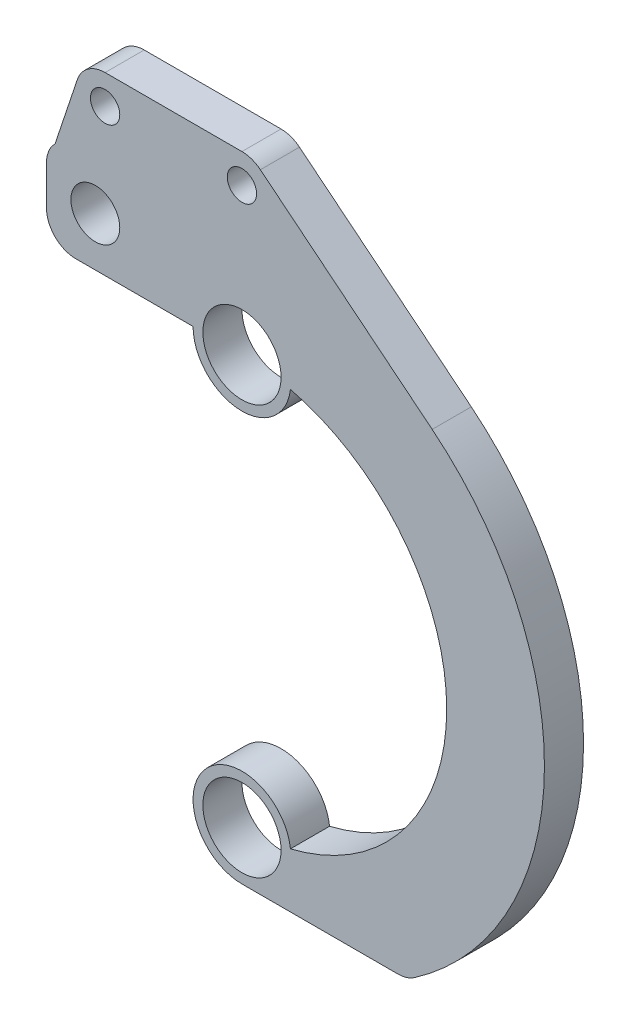
ISO-10303-21;
HEADER;
FILE_DESCRIPTION(('STEP AP214'),'2;1');
FILE_NAME('part.step','',(''),(''),'','','');
FILE_SCHEMA(('AUTOMOTIVE_DESIGN { 1 0 10303 214 1 1 1 1 }'));
ENDSEC;
DATA;
#1=APPLICATION_CONTEXT('core data for automotive mechanical design processes');
#2=APPLICATION_PROTOCOL_DEFINITION('international standard','automotive_design',2000,#1);
#3=PRODUCT_CONTEXT('',#1,'mechanical');
#4=PRODUCT('Part','Part','',(#3));
#5=PRODUCT_RELATED_PRODUCT_CATEGORY('part','',(#4));
#6=PRODUCT_DEFINITION_FORMATION('','',#4);
#7=PRODUCT_DEFINITION_CONTEXT('part definition',#1,'design');
#8=PRODUCT_DEFINITION('design','',#6,#7);
#9=PRODUCT_DEFINITION_SHAPE('','',#8);
#10=(LENGTH_UNIT() NAMED_UNIT(*) SI_UNIT(.MILLI.,.METRE.));
#11=(NAMED_UNIT(*) PLANE_ANGLE_UNIT() SI_UNIT($,.RADIAN.));
#12=(NAMED_UNIT(*) SI_UNIT($,.STERADIAN.) SOLID_ANGLE_UNIT());
#13=UNCERTAINTY_MEASURE_WITH_UNIT(LENGTH_MEASURE(1.E-05),#10,'distance_accuracy_value','');
#14=(GEOMETRIC_REPRESENTATION_CONTEXT(3) GLOBAL_UNCERTAINTY_ASSIGNED_CONTEXT((#13)) GLOBAL_UNIT_ASSIGNED_CONTEXT((#10,
#11,#12)) REPRESENTATION_CONTEXT('',''));
#15=CARTESIAN_POINT('',(0.,0.,0.));
#16=DIRECTION('',(0.,0.,1.));
#17=DIRECTION('',(1.,0.,0.));
#18=AXIS2_PLACEMENT_3D('',#15,#16,#17);
#19=CARTESIAN_POINT('',(-26.2297262447128,8.7412550388306,4.));
#20=DIRECTION('',(0.948704856693015,-0.316163082739092,0.));
#21=DIRECTION('',(0.316163082739092,0.948704856693015,0.));
#22=AXIS2_PLACEMENT_3D('',#19,#20,#21);
#23=PLANE('',#22);
#24=DIRECTION('',(-0.316163082739092,-0.948704856693015,0.));
#25=VECTOR('',#24,1.);
#26=CARTESIAN_POINT('',(-26.2297262447128,8.7412550388306,0.));
#27=LINE('',#26,#25);
#28=CARTESIAN_POINT('',(-16.846114570079,36.8984892482173,0.));
#29=VERTEX_POINT('',#28);
#30=CARTESIAN_POINT('',(-19.1213203435596,30.0713203435596,0.));
#31=VERTEX_POINT('',#30);
#32=EDGE_CURVE('E187',#29,#31,#27,.T.);
#33=ORIENTED_EDGE('',*,*,#32,.T.);
#34=DIRECTION('',(0.,0.,-1.));
#35=VECTOR('',#34,1.);
#36=CARTESIAN_POINT('',(-19.1213203435596,30.0713203435596,4.));
#37=LINE('',#36,#35);
#38=CARTESIAN_POINT('',(-19.1213203435596,30.0713203435596,4.));
#39=VERTEX_POINT('',#38);
#40=EDGE_CURVE('E11',#39,#31,#37,.T.);
#41=ORIENTED_EDGE('',*,*,#40,.F.);
#42=DIRECTION('',(-0.316163082739092,-0.948704856693015,0.));
#43=VECTOR('',#42,1.);
#44=CARTESIAN_POINT('',(-26.2297262447128,8.7412550388306,4.));
#45=LINE('',#44,#43);
#46=CARTESIAN_POINT('',(-16.846114570079,36.8984892482173,4.));
#47=VERTEX_POINT('',#46);
#48=EDGE_CURVE('E239',#47,#39,#45,.T.);
#49=ORIENTED_EDGE('',*,*,#48,.F.);
#50=DIRECTION('',(0.,0.,-1.));
#51=VECTOR('',#50,1.);
#52=CARTESIAN_POINT('',(-16.846114570079,36.8984892482173,4.));
#53=LINE('',#52,#51);
#54=EDGE_CURVE('E186',#47,#29,#53,.T.);
#55=ORIENTED_EDGE('',*,*,#54,.T.);
#56=EDGE_LOOP('',(#33,#41,#49,#55));
#57=FACE_BOUND('',#56,.T.);
#58=ADVANCED_FACE('F35',(#57),#23,.F.);
#59=CARTESIAN_POINT('',(-17.,27.95,4.));
#60=DIRECTION('',(0.,0.,-1.));
#61=DIRECTION('',(-1.,0.,0.));
#62=AXIS2_PLACEMENT_3D('',#59,#60,#61);
#63=CYLINDRICAL_SURFACE('',#62,3.);
#64=CARTESIAN_POINT('',(-17.,27.95,0.));
#65=DIRECTION('',(0.,0.,1.));
#66=DIRECTION('',(1.,0.,0.));
#67=AXIS2_PLACEMENT_3D('',#64,#65,#66);
#68=CIRCLE('',#67,3.);
#69=CARTESIAN_POINT('',(-20.,27.95,0.));
#70=VERTEX_POINT('',#69);
#71=EDGE_CURVE('E190',#31,#70,#68,.T.);
#72=ORIENTED_EDGE('',*,*,#71,.T.);
#73=DIRECTION('',(0.,0.,-1.));
#74=VECTOR('',#73,1.);
#75=CARTESIAN_POINT('',(-20.,27.95,4.));
#76=LINE('',#75,#74);
#77=CARTESIAN_POINT('',(-20.,27.95,4.));
#78=VERTEX_POINT('',#77);
#79=EDGE_CURVE('E43',#78,#70,#76,.T.);
#80=ORIENTED_EDGE('',*,*,#79,.F.);
#81=CARTESIAN_POINT('',(-17.,27.95,4.));
#82=DIRECTION('',(0.,0.,1.));
#83=DIRECTION('',(1.,0.,0.));
#84=AXIS2_PLACEMENT_3D('',#81,#82,#83);
#85=CIRCLE('',#84,3.);
#86=EDGE_CURVE('E111',#39,#78,#85,.T.);
#87=ORIENTED_EDGE('',*,*,#86,.F.);
#88=ORIENTED_EDGE('',*,*,#40,.T.);
#89=EDGE_LOOP('',(#72,#80,#87,#88));
#90=FACE_BOUND('',#89,.T.);
#91=ADVANCED_FACE('F269',(#90),#63,.T.);
#92=CARTESIAN_POINT('',(-20.,0.,4.));
#93=DIRECTION('',(-1.,0.,0.));
#94=DIRECTION('',(0.,0.,1.));
#95=AXIS2_PLACEMENT_3D('',#92,#93,#94);
#96=PLANE('',#95);
#97=DIRECTION('',(0.,1.,0.));
#98=VECTOR('',#97,1.);
#99=CARTESIAN_POINT('',(-20.,0.,0.));
#100=LINE('',#99,#98);
#101=CARTESIAN_POINT('',(-20.,23.95,0.));
#102=VERTEX_POINT('',#101);
#103=EDGE_CURVE('E193',#102,#70,#100,.T.);
#104=ORIENTED_EDGE('',*,*,#103,.F.);
#105=DIRECTION('',(0.,0.,-1.));
#106=VECTOR('',#105,1.);
#107=CARTESIAN_POINT('',(-20.,23.95,4.));
#108=LINE('',#107,#106);
#109=CARTESIAN_POINT('',(-20.,23.95,4.));
#110=VERTEX_POINT('',#109);
#111=EDGE_CURVE('E262',#110,#102,#108,.T.);
#112=ORIENTED_EDGE('',*,*,#111,.F.);
#113=DIRECTION('',(0.,1.,0.));
#114=VECTOR('',#113,1.);
#115=CARTESIAN_POINT('',(-20.,0.,4.));
#116=LINE('',#115,#114);
#117=EDGE_CURVE('E268',#110,#78,#116,.T.);
#118=ORIENTED_EDGE('',*,*,#117,.T.);
#119=ORIENTED_EDGE('',*,*,#79,.T.);
#120=EDGE_LOOP('',(#104,#112,#118,#119));
#121=FACE_BOUND('',#120,.T.);
#122=ADVANCED_FACE('F266',(#121),#96,.T.);
#123=CARTESIAN_POINT('',(-17.,23.95,4.));
#124=DIRECTION('',(0.,0.,-1.));
#125=DIRECTION('',(-1.,0.,0.));
#126=AXIS2_PLACEMENT_3D('',#123,#124,#125);
#127=CYLINDRICAL_SURFACE('',#126,3.);
#128=CARTESIAN_POINT('',(-17.,23.95,0.));
#129=DIRECTION('',(0.,0.,1.));
#130=DIRECTION('',(1.,0.,0.));
#131=AXIS2_PLACEMENT_3D('',#128,#129,#130);
#132=CIRCLE('',#131,3.);
#133=CARTESIAN_POINT('',(-17.,20.95,0.));
#134=VERTEX_POINT('',#133);
#135=EDGE_CURVE('E196',#134,#102,#132,.F.);
#136=ORIENTED_EDGE('',*,*,#135,.F.);
#137=DIRECTION('',(0.,0.,-1.));
#138=VECTOR('',#137,1.);
#139=CARTESIAN_POINT('',(-17.,20.95,4.));
#140=LINE('',#139,#138);
#141=CARTESIAN_POINT('',(-17.,20.95,4.));
#142=VERTEX_POINT('',#141);
#143=EDGE_CURVE('E260',#142,#134,#140,.T.);
#144=ORIENTED_EDGE('',*,*,#143,.F.);
#145=CARTESIAN_POINT('',(-17.,23.95,4.));
#146=DIRECTION('',(0.,0.,1.));
#147=DIRECTION('',(1.,0.,0.));
#148=AXIS2_PLACEMENT_3D('',#145,#146,#147);
#149=CIRCLE('',#148,3.);
#150=EDGE_CURVE('E282',#142,#110,#149,.F.);
#151=ORIENTED_EDGE('',*,*,#150,.T.);
#152=ORIENTED_EDGE('',*,*,#111,.T.);
#153=EDGE_LOOP('',(#136,#144,#151,#152));
#154=FACE_BOUND('',#153,.T.);
#155=ADVANCED_FACE('F279',(#154),#127,.T.);
#156=CARTESIAN_POINT('',(0.,20.95,4.));
#157=DIRECTION('',(0.,-1.,0.));
#158=DIRECTION('',(1.,0.,0.));
#159=AXIS2_PLACEMENT_3D('',#156,#157,#158);
#160=PLANE('',#159);
#161=DIRECTION('',(-1.,0.,0.));
#162=VECTOR('',#161,1.);
#163=CARTESIAN_POINT('',(0.,20.95,0.));
#164=LINE('',#163,#162);
#165=CARTESIAN_POINT('',(-5.,20.95,0.));
#166=VERTEX_POINT('',#165);
#167=EDGE_CURVE('E199',#166,#134,#164,.T.);
#168=ORIENTED_EDGE('',*,*,#167,.F.);
#169=DIRECTION('',(0.,0.,-1.));
#170=VECTOR('',#169,1.);
#171=CARTESIAN_POINT('',(-5.,20.95,4.));
#172=LINE('',#171,#170);
#173=CARTESIAN_POINT('',(-5.,20.95,4.));
#174=VERTEX_POINT('',#173);
#175=EDGE_CURVE('E258',#174,#166,#172,.T.);
#176=ORIENTED_EDGE('',*,*,#175,.F.);
#177=DIRECTION('',(-1.,0.,0.));
#178=VECTOR('',#177,1.);
#179=CARTESIAN_POINT('',(0.,20.95,4.));
#180=LINE('',#179,#178);
#181=EDGE_CURVE('E286',#174,#142,#180,.T.);
#182=ORIENTED_EDGE('',*,*,#181,.T.);
#183=ORIENTED_EDGE('',*,*,#143,.T.);
#184=EDGE_LOOP('',(#168,#176,#182,#183));
#185=FACE_BOUND('',#184,.T.);
#186=ADVANCED_FACE('F337',(#185),#160,.T.);
#187=CARTESIAN_POINT('',(0.,20.95,4.));
#188=DIRECTION('',(0.,0.,-1.));
#189=DIRECTION('',(-1.,0.,0.));
#190=AXIS2_PLACEMENT_3D('',#187,#188,#189);
#191=CYLINDRICAL_SURFACE('',#190,5.);
#192=CARTESIAN_POINT('',(0.,20.95,0.));
#193=DIRECTION('',(0.,0.,1.));
#194=DIRECTION('',(1.,0.,0.));
#195=AXIS2_PLACEMENT_3D('',#192,#193,#194);
#196=CIRCLE('',#195,5.);
#197=CARTESIAN_POINT('',(4.96427219059639,20.3533412887828,0.));
#198=VERTEX_POINT('',#197);
#199=EDGE_CURVE('E202',#166,#198,#196,.T.);
#200=ORIENTED_EDGE('',*,*,#199,.T.);
#201=DIRECTION('',(0.,0.,-1.));
#202=VECTOR('',#201,1.);
#203=CARTESIAN_POINT('',(4.96427219059639,20.3533412887828,4.));
#204=LINE('',#203,#202);
#205=CARTESIAN_POINT('',(4.96427219059639,20.3533412887828,4.));
#206=VERTEX_POINT('',#205);
#207=EDGE_CURVE('E256',#206,#198,#204,.T.);
#208=ORIENTED_EDGE('',*,*,#207,.F.);
#209=CARTESIAN_POINT('',(0.,20.95,4.));
#210=DIRECTION('',(0.,0.,1.));
#211=DIRECTION('',(1.,0.,0.));
#212=AXIS2_PLACEMENT_3D('',#209,#210,#211);
#213=CIRCLE('',#212,5.);
#214=EDGE_CURVE('E292',#174,#206,#213,.T.);
#215=ORIENTED_EDGE('',*,*,#214,.F.);
#216=ORIENTED_EDGE('',*,*,#175,.T.);
#217=EDGE_LOOP('',(#200,#208,#215,#216));
#218=FACE_BOUND('',#217,.T.);
#219=ADVANCED_FACE('F340',(#218),#191,.T.);
#220=CARTESIAN_POINT('',(0.,0.,4.));
#221=DIRECTION('',(0.,0.,-1.));
#222=DIRECTION('',(-1.,0.,0.));
#223=AXIS2_PLACEMENT_3D('',#220,#221,#222);
#224=CYLINDRICAL_SURFACE('',#223,20.95);
#225=CARTESIAN_POINT('',(0.,0.,0.));
#226=DIRECTION('',(0.,0.,1.));
#227=DIRECTION('',(1.,0.,0.));
#228=AXIS2_PLACEMENT_3D('',#225,#226,#227);
#229=CIRCLE('',#228,20.95);
#230=CARTESIAN_POINT('',(4.96427219059625,-20.3533412887829,0.));
#231=VERTEX_POINT('',#230);
#232=EDGE_CURVE('E205',#231,#198,#229,.T.);
#233=ORIENTED_EDGE('',*,*,#232,.F.);
#234=DIRECTION('',(0.,0.,-1.));
#235=VECTOR('',#234,1.);
#236=CARTESIAN_POINT('',(4.96427219059625,-20.3533412887829,4.));
#237=LINE('',#236,#235);
#238=CARTESIAN_POINT('',(4.96427219059625,-20.3533412887829,4.));
#239=VERTEX_POINT('',#238);
#240=EDGE_CURVE('E254',#239,#231,#237,.T.);
#241=ORIENTED_EDGE('',*,*,#240,.F.);
#242=CARTESIAN_POINT('',(0.,0.,4.));
#243=DIRECTION('',(0.,0.,1.));
#244=DIRECTION('',(1.,0.,0.));
#245=AXIS2_PLACEMENT_3D('',#242,#243,#244);
#246=CIRCLE('',#245,20.95);
#247=EDGE_CURVE('E294',#239,#206,#246,.T.);
#248=ORIENTED_EDGE('',*,*,#247,.T.);
#249=ORIENTED_EDGE('',*,*,#207,.T.);
#250=EDGE_LOOP('',(#233,#241,#248,#249));
#251=FACE_BOUND('',#250,.T.);
#252=ADVANCED_FACE('F344',(#251),#224,.F.);
#253=CARTESIAN_POINT('',(-1.46293068097527E-13,-20.95,4.));
#254=DIRECTION('',(0.,0.,-1.));
#255=DIRECTION('',(-1.,0.,0.));
#256=AXIS2_PLACEMENT_3D('',#253,#254,#255);
#257=CYLINDRICAL_SURFACE('',#256,5.);
#258=CARTESIAN_POINT('',(-1.46293068097527E-13,-20.95,0.));
#259=DIRECTION('',(0.,0.,1.));
#260=DIRECTION('',(1.,0.,0.));
#261=AXIS2_PLACEMENT_3D('',#258,#259,#260);
#262=CIRCLE('',#261,5.);
#263=CARTESIAN_POINT('',(-1.63750471515078E-13,-25.95,0.));
#264=VERTEX_POINT('',#263);
#265=EDGE_CURVE('E208',#231,#264,#262,.T.);
#266=ORIENTED_EDGE('',*,*,#265,.T.);
#267=DIRECTION('',(0.,0.,-1.));
#268=VECTOR('',#267,1.);
#269=CARTESIAN_POINT('',(-1.63750471515078E-13,-25.95,4.));
#270=LINE('',#269,#268);
#271=CARTESIAN_POINT('',(-1.63750471515078E-13,-25.95,4.));
#272=VERTEX_POINT('',#271);
#273=EDGE_CURVE('E251',#272,#264,#270,.T.);
#274=ORIENTED_EDGE('',*,*,#273,.F.);
#275=CARTESIAN_POINT('',(-1.46293068097527E-13,-20.95,4.));
#276=DIRECTION('',(0.,0.,1.));
#277=DIRECTION('',(1.,0.,0.));
#278=AXIS2_PLACEMENT_3D('',#275,#276,#277);
#279=CIRCLE('',#278,5.);
#280=EDGE_CURVE('E297',#239,#272,#279,.T.);
#281=ORIENTED_EDGE('',*,*,#280,.F.);
#282=ORIENTED_EDGE('',*,*,#240,.T.);
#283=EDGE_LOOP('',(#266,#274,#281,#282));
#284=FACE_BOUND('',#283,.T.);
#285=ADVANCED_FACE('F348',(#284),#257,.T.);
#286=CARTESIAN_POINT('',(0.,-25.95,4.));
#287=DIRECTION('',(0.,1.,0.));
#288=DIRECTION('',(-1.,0.,0.));
#289=AXIS2_PLACEMENT_3D('',#286,#287,#288);
#290=PLANE('',#289);
#291=DIRECTION('',(1.,0.,0.));
#292=VECTOR('',#291,1.);
#293=CARTESIAN_POINT('',(0.,-25.95,0.));
#294=LINE('',#293,#292);
#295=CARTESIAN_POINT('',(15.9530561335437,-25.9500000000001,0.));
#296=VERTEX_POINT('',#295);
#297=EDGE_CURVE('E210',#264,#296,#294,.T.);
#298=ORIENTED_EDGE('',*,*,#297,.T.);
#299=DIRECTION('',(0.,0.,-1.));
#300=VECTOR('',#299,1.);
#301=CARTESIAN_POINT('',(15.9530561335437,-25.9500000000001,4.));
#302=LINE('',#301,#300);
#303=CARTESIAN_POINT('',(15.9530561335437,-25.9500000000001,4.));
#304=VERTEX_POINT('',#303);
#305=EDGE_CURVE('E248',#304,#296,#302,.T.);
#306=ORIENTED_EDGE('',*,*,#305,.F.);
#307=DIRECTION('',(1.,0.,0.));
#308=VECTOR('',#307,1.);
#309=CARTESIAN_POINT('',(0.,-25.95,4.));
#310=LINE('',#309,#308);
#311=EDGE_CURVE('E299',#272,#304,#310,.T.);
#312=ORIENTED_EDGE('',*,*,#311,.F.);
#313=ORIENTED_EDGE('',*,*,#273,.T.);
#314=EDGE_LOOP('',(#298,#306,#312,#313));
#315=FACE_BOUND('',#314,.T.);
#316=ADVANCED_FACE('F352',(#315),#290,.F.);
#317=CARTESIAN_POINT('',(15.9530561335437,-22.9500000000001,4.));
#318=DIRECTION('',(0.,0.,-1.));
#319=DIRECTION('',(-1.,0.,0.));
#320=AXIS2_PLACEMENT_3D('',#317,#318,#319);
#321=CYLINDRICAL_SURFACE('',#320,3.);
#322=CARTESIAN_POINT('',(15.9530561335437,-22.9500000000001,0.));
#323=DIRECTION('',(0.,0.,1.));
#324=DIRECTION('',(1.,0.,0.));
#325=AXIS2_PLACEMENT_3D('',#322,#323,#324);
#326=CIRCLE('',#325,3.);
#327=CARTESIAN_POINT('',(17.6653698509187,-25.4133273703042,0.));
#328=VERTEX_POINT('',#327);
#329=EDGE_CURVE('E212',#296,#328,#326,.T.);
#330=ORIENTED_EDGE('',*,*,#329,.T.);
#331=DIRECTION('',(0.,0.,-1.));
#332=VECTOR('',#331,1.);
#333=CARTESIAN_POINT('',(17.6653698509187,-25.4133273703042,4.));
#334=LINE('',#333,#332);
#335=CARTESIAN_POINT('',(17.6653698509187,-25.4133273703042,4.));
#336=VERTEX_POINT('',#335);
#337=EDGE_CURVE('E245',#336,#328,#334,.T.);
#338=ORIENTED_EDGE('',*,*,#337,.F.);
#339=CARTESIAN_POINT('',(15.9530561335437,-22.9500000000001,4.));
#340=DIRECTION('',(0.,0.,1.));
#341=DIRECTION('',(1.,0.,0.));
#342=AXIS2_PLACEMENT_3D('',#339,#340,#341);
#343=CIRCLE('',#342,3.);
#344=EDGE_CURVE('E301',#304,#336,#343,.T.);
#345=ORIENTED_EDGE('',*,*,#344,.F.);
#346=ORIENTED_EDGE('',*,*,#305,.T.);
#347=EDGE_LOOP('',(#330,#338,#345,#346));
#348=FACE_BOUND('',#347,.T.);
#349=ADVANCED_FACE('F356',(#348),#321,.T.);
#350=CARTESIAN_POINT('',(0.,0.,4.));
#351=DIRECTION('',(0.,0.,-1.));
#352=DIRECTION('',(-1.,0.,0.));
#353=AXIS2_PLACEMENT_3D('',#350,#351,#352);
#354=CYLINDRICAL_SURFACE('',#353,30.95);
#355=CARTESIAN_POINT('',(0.,0.,0.));
#356=DIRECTION('',(0.,0.,1.));
#357=DIRECTION('',(1.,0.,0.));
#358=AXIS2_PLACEMENT_3D('',#355,#356,#357);
#359=CIRCLE('',#358,30.95);
#360=CARTESIAN_POINT('',(19.4651242928461,24.0626564673157,0.));
#361=VERTEX_POINT('',#360);
#362=EDGE_CURVE('E214',#328,#361,#359,.T.);
#363=ORIENTED_EDGE('',*,*,#362,.T.);
#364=DIRECTION('',(0.,0.,-1.));
#365=VECTOR('',#364,1.);
#366=CARTESIAN_POINT('',(19.4651242928461,24.0626564673157,4.));
#367=LINE('',#366,#365);
#368=CARTESIAN_POINT('',(19.4651242928461,24.0626564673157,4.));
#369=VERTEX_POINT('',#368);
#370=EDGE_CURVE('E243',#369,#361,#367,.T.);
#371=ORIENTED_EDGE('',*,*,#370,.F.);
#372=CARTESIAN_POINT('',(0.,0.,4.));
#373=DIRECTION('',(0.,0.,1.));
#374=DIRECTION('',(1.,0.,0.));
#375=AXIS2_PLACEMENT_3D('',#372,#373,#374);
#376=CIRCLE('',#375,30.95);
#377=EDGE_CURVE('E303',#336,#369,#376,.T.);
#378=ORIENTED_EDGE('',*,*,#377,.F.);
#379=ORIENTED_EDGE('',*,*,#337,.T.);
#380=EDGE_LOOP('',(#363,#371,#378,#379));
#381=FACE_BOUND('',#380,.T.);
#382=ADVANCED_FACE('F360',(#381),#354,.T.);
#383=CARTESIAN_POINT('',(19.4651242928461,24.0626564673157,4.));
#384=DIRECTION('',(0.628921624970796,0.777468706536857,0.));
#385=DIRECTION('',(-0.777468706536857,0.628921624970796,0.));
#386=AXIS2_PLACEMENT_3D('',#383,#384,#385);
#387=PLANE('',#386);
#388=DIRECTION('',(0.777468706536857,-0.628921624970796,0.));
#389=VECTOR('',#388,1.);
#390=CARTESIAN_POINT('',(19.4651242928461,24.0626564673157,0.));
#391=LINE('',#390,#389);
#392=CARTESIAN_POINT('',(1.88676487491238,38.2824061196106,0.));
#393=VERTEX_POINT('',#392);
#394=EDGE_CURVE('E217',#393,#361,#391,.T.);
#395=ORIENTED_EDGE('',*,*,#394,.F.);
#396=DIRECTION('',(0.,0.,-1.));
#397=VECTOR('',#396,1.);
#398=CARTESIAN_POINT('',(1.88676487491238,38.2824061196106,4.));
#399=LINE('',#398,#397);
#400=CARTESIAN_POINT('',(1.88676487491238,38.2824061196106,4.));
#401=VERTEX_POINT('',#400);
#402=EDGE_CURVE('E164',#401,#393,#399,.T.);
#403=ORIENTED_EDGE('',*,*,#402,.F.);
#404=DIRECTION('',(0.777468706536857,-0.628921624970796,0.));
#405=VECTOR('',#404,1.);
#406=CARTESIAN_POINT('',(19.4651242928461,24.0626564673157,4.));
#407=LINE('',#406,#405);
#408=EDGE_CURVE('E153',#401,#369,#407,.T.);
#409=ORIENTED_EDGE('',*,*,#408,.T.);
#410=ORIENTED_EDGE('',*,*,#370,.T.);
#411=EDGE_LOOP('',(#395,#403,#409,#410));
#412=FACE_BOUND('',#411,.T.);
#413=ADVANCED_FACE('F306',(#412),#387,.T.);
#414=CARTESIAN_POINT('',(0.,35.95,4.));
#415=DIRECTION('',(0.,0.,-1.));
#416=DIRECTION('',(-1.,0.,0.));
#417=AXIS2_PLACEMENT_3D('',#414,#415,#416);
#418=CYLINDRICAL_SURFACE('',#417,3.);
#419=CARTESIAN_POINT('',(0.,35.95,0.));
#420=DIRECTION('',(0.,0.,1.));
#421=DIRECTION('',(1.,0.,0.));
#422=AXIS2_PLACEMENT_3D('',#419,#420,#421);
#423=CIRCLE('',#422,3.);
#424=CARTESIAN_POINT('',(0.,38.95,0.));
#425=VERTEX_POINT('',#424);
#426=EDGE_CURVE('E160',#393,#425,#423,.T.);
#427=ORIENTED_EDGE('',*,*,#426,.T.);
#428=DIRECTION('',(0.,0.,-1.));
#429=VECTOR('',#428,1.);
#430=CARTESIAN_POINT('',(0.,38.95,4.));
#431=LINE('',#430,#429);
#432=CARTESIAN_POINT('',(0.,38.95,4.));
#433=VERTEX_POINT('',#432);
#434=EDGE_CURVE('E157',#433,#425,#431,.T.);
#435=ORIENTED_EDGE('',*,*,#434,.F.);
#436=CARTESIAN_POINT('',(0.,35.95,4.));
#437=DIRECTION('',(0.,0.,1.));
#438=DIRECTION('',(1.,0.,0.));
#439=AXIS2_PLACEMENT_3D('',#436,#437,#438);
#440=CIRCLE('',#439,3.);
#441=EDGE_CURVE('E146',#401,#433,#440,.T.);
#442=ORIENTED_EDGE('',*,*,#441,.F.);
#443=ORIENTED_EDGE('',*,*,#402,.T.);
#444=EDGE_LOOP('',(#427,#435,#442,#443));
#445=FACE_BOUND('',#444,.T.);
#446=ADVANCED_FACE('F158',(#445),#418,.T.);
#447=CARTESIAN_POINT('',(0.,38.95,4.));
#448=DIRECTION('',(0.,1.,0.));
#449=DIRECTION('',(0.,0.,1.));
#450=AXIS2_PLACEMENT_3D('',#447,#448,#449);
#451=PLANE('',#450);
#452=DIRECTION('',(1.,0.,0.));
#453=VECTOR('',#452,1.);
#454=CARTESIAN_POINT('',(0.,38.95,0.));
#455=LINE('',#454,#453);
#456=CARTESIAN_POINT('',(-14.,38.95,0.));
#457=VERTEX_POINT('',#456);
#458=EDGE_CURVE('E221',#457,#425,#455,.T.);
#459=ORIENTED_EDGE('',*,*,#458,.F.);
#460=DIRECTION('',(0.,0.,-1.));
#461=VECTOR('',#460,1.);
#462=CARTESIAN_POINT('',(-14.,38.95,4.));
#463=LINE('',#462,#461);
#464=CARTESIAN_POINT('',(-14.,38.95,4.));
#465=VERTEX_POINT('',#464);
#466=EDGE_CURVE('E100',#465,#457,#463,.T.);
#467=ORIENTED_EDGE('',*,*,#466,.F.);
#468=DIRECTION('',(1.,0.,0.));
#469=VECTOR('',#468,1.);
#470=CARTESIAN_POINT('',(0.,38.95,4.));
#471=LINE('',#470,#469);
#472=EDGE_CURVE('E151',#465,#433,#471,.T.);
#473=ORIENTED_EDGE('',*,*,#472,.T.);
#474=ORIENTED_EDGE('',*,*,#434,.T.);
#475=EDGE_LOOP('',(#459,#467,#473,#474));
#476=FACE_BOUND('',#475,.T.);
#477=ADVANCED_FACE('F166',(#476),#451,.T.);
#478=CARTESIAN_POINT('',(-14.,35.95,4.));
#479=DIRECTION('',(0.,0.,-1.));
#480=DIRECTION('',(-1.,0.,0.));
#481=AXIS2_PLACEMENT_3D('',#478,#479,#480);
#482=CYLINDRICAL_SURFACE('',#481,1.5);
#483=CARTESIAN_POINT('',(-14.,35.95,4.));
#484=DIRECTION('',(0.,0.,1.));
#485=DIRECTION('',(1.,0.,0.));
#486=AXIS2_PLACEMENT_3D('',#483,#484,#485);
#487=CIRCLE('',#486,1.5);
#488=CARTESIAN_POINT('',(-12.5,35.95,4.));
#489=VERTEX_POINT('',#488);
#490=EDGE_CURVE('E180',#489,#489,#487,.T.);
#491=ORIENTED_EDGE('',*,*,#490,.T.);
#492=EDGE_LOOP('',(#491));
#493=FACE_BOUND('',#492,.T.);
#494=CARTESIAN_POINT('',(-14.,35.95,0.));
#495=DIRECTION('',(0.,0.,1.));
#496=DIRECTION('',(1.,0.,0.));
#497=AXIS2_PLACEMENT_3D('',#494,#495,#496);
#498=CIRCLE('',#497,1.5);
#499=CARTESIAN_POINT('',(-12.5,35.95,0.));
#500=VERTEX_POINT('',#499);
#501=EDGE_CURVE('E233',#500,#500,#498,.T.);
#502=ORIENTED_EDGE('',*,*,#501,.F.);
#503=EDGE_LOOP('',(#502));
#504=FACE_BOUND('',#503,.T.);
#505=ADVANCED_FACE('F369',(#493,#504),#482,.F.);
#506=CARTESIAN_POINT('',(-15.,25.95,4.));
#507=DIRECTION('',(0.,0.,-1.));
#508=DIRECTION('',(-1.,0.,0.));
#509=AXIS2_PLACEMENT_3D('',#506,#507,#508);
#510=CYLINDRICAL_SURFACE('',#509,2.5);
#511=CARTESIAN_POINT('',(-15.,25.95,4.));
#512=DIRECTION('',(0.,0.,1.));
#513=DIRECTION('',(1.,0.,0.));
#514=AXIS2_PLACEMENT_3D('',#511,#512,#513);
#515=CIRCLE('',#514,2.5);
#516=CARTESIAN_POINT('',(-12.5,25.95,4.));
#517=VERTEX_POINT('',#516);
#518=EDGE_CURVE('E177',#517,#517,#515,.T.);
#519=ORIENTED_EDGE('',*,*,#518,.T.);
#520=EDGE_LOOP('',(#519));
#521=FACE_BOUND('',#520,.T.);
#522=CARTESIAN_POINT('',(-15.,25.95,0.));
#523=DIRECTION('',(0.,0.,1.));
#524=DIRECTION('',(1.,0.,0.));
#525=AXIS2_PLACEMENT_3D('',#522,#523,#524);
#526=CIRCLE('',#525,2.5);
#527=CARTESIAN_POINT('',(-12.5,25.95,0.));
#528=VERTEX_POINT('',#527);
#529=EDGE_CURVE('E230',#528,#528,#526,.T.);
#530=ORIENTED_EDGE('',*,*,#529,.F.);
#531=EDGE_LOOP('',(#530));
#532=FACE_BOUND('',#531,.T.);
#533=ADVANCED_FACE('F373',(#521,#532),#510,.F.);
#534=CARTESIAN_POINT('',(-1.46293068097527E-13,-20.95,4.));
#535=DIRECTION('',(0.,0.,-1.));
#536=DIRECTION('',(-1.,0.,0.));
#537=AXIS2_PLACEMENT_3D('',#534,#535,#536);
#538=CYLINDRICAL_SURFACE('',#537,4.);
#539=CARTESIAN_POINT('',(-1.46293068097527E-13,-20.95,4.));
#540=DIRECTION('',(0.,0.,1.));
#541=DIRECTION('',(1.,0.,0.));
#542=AXIS2_PLACEMENT_3D('',#539,#540,#541);
#543=CIRCLE('',#542,4.);
#544=CARTESIAN_POINT('',(3.99999999999986,-20.95,4.));
#545=VERTEX_POINT('',#544);
#546=EDGE_CURVE('E174',#545,#545,#543,.T.);
#547=ORIENTED_EDGE('',*,*,#546,.T.);
#548=EDGE_LOOP('',(#547));
#549=FACE_BOUND('',#548,.T.);
#550=CARTESIAN_POINT('',(-1.46293068097527E-13,-20.95,0.));
#551=DIRECTION('',(0.,0.,1.));
#552=DIRECTION('',(1.,0.,0.));
#553=AXIS2_PLACEMENT_3D('',#550,#551,#552);
#554=CIRCLE('',#553,4.);
#555=CARTESIAN_POINT('',(3.99999999999986,-20.95,0.));
#556=VERTEX_POINT('',#555);
#557=EDGE_CURVE('E227',#556,#556,#554,.T.);
#558=ORIENTED_EDGE('',*,*,#557,.F.);
#559=EDGE_LOOP('',(#558));
#560=FACE_BOUND('',#559,.T.);
#561=ADVANCED_FACE('F322',(#549,#560),#538,.F.);
#562=CARTESIAN_POINT('',(0.,20.95,4.));
#563=DIRECTION('',(0.,0.,-1.));
#564=DIRECTION('',(-1.,0.,0.));
#565=AXIS2_PLACEMENT_3D('',#562,#563,#564);
#566=CYLINDRICAL_SURFACE('',#565,4.);
#567=CARTESIAN_POINT('',(0.,20.95,4.));
#568=DIRECTION('',(0.,0.,1.));
#569=DIRECTION('',(1.,0.,0.));
#570=AXIS2_PLACEMENT_3D('',#567,#568,#569);
#571=CIRCLE('',#570,4.);
#572=CARTESIAN_POINT('',(4.,20.95,4.));
#573=VERTEX_POINT('',#572);
#574=EDGE_CURVE('E168',#573,#573,#571,.T.);
#575=ORIENTED_EDGE('',*,*,#574,.T.);
#576=EDGE_LOOP('',(#575));
#577=FACE_BOUND('',#576,.T.);
#578=CARTESIAN_POINT('',(0.,20.95,0.));
#579=DIRECTION('',(0.,0.,1.));
#580=DIRECTION('',(1.,0.,0.));
#581=AXIS2_PLACEMENT_3D('',#578,#579,#580);
#582=CIRCLE('',#581,4.);
#583=CARTESIAN_POINT('',(4.,20.95,0.));
#584=VERTEX_POINT('',#583);
#585=EDGE_CURVE('E224',#584,#584,#582,.T.);
#586=ORIENTED_EDGE('',*,*,#585,.F.);
#587=EDGE_LOOP('',(#586));
#588=FACE_BOUND('',#587,.T.);
#589=ADVANCED_FACE('F314',(#577,#588),#566,.F.);
#590=CARTESIAN_POINT('',(-14.,35.95,4.));
#591=DIRECTION('',(0.,0.,-1.));
#592=DIRECTION('',(-1.,0.,0.));
#593=AXIS2_PLACEMENT_3D('',#590,#591,#592);
#594=CYLINDRICAL_SURFACE('',#593,3.);
#595=CARTESIAN_POINT('',(-14.,35.95,0.));
#596=DIRECTION('',(0.,0.,1.));
#597=DIRECTION('',(1.,0.,0.));
#598=AXIS2_PLACEMENT_3D('',#595,#596,#597);
#599=CIRCLE('',#598,3.);
#600=EDGE_CURVE('E103',#457,#29,#599,.T.);
#601=ORIENTED_EDGE('',*,*,#600,.T.);
#602=ORIENTED_EDGE('',*,*,#54,.F.);
#603=CARTESIAN_POINT('',(-14.,35.95,4.));
#604=DIRECTION('',(0.,0.,1.));
#605=DIRECTION('',(1.,0.,0.));
#606=AXIS2_PLACEMENT_3D('',#603,#604,#605);
#607=CIRCLE('',#606,3.);
#608=EDGE_CURVE('E51',#465,#47,#607,.T.);
#609=ORIENTED_EDGE('',*,*,#608,.F.);
#610=ORIENTED_EDGE('',*,*,#466,.T.);
#611=EDGE_LOOP('',(#601,#602,#609,#610));
#612=FACE_BOUND('',#611,.T.);
#613=ADVANCED_FACE('F311',(#612),#594,.T.);
#614=CARTESIAN_POINT('',(0.,35.95,4.));
#615=DIRECTION('',(0.,0.,-1.));
#616=DIRECTION('',(-1.,0.,0.));
#617=AXIS2_PLACEMENT_3D('',#614,#615,#616);
#618=CYLINDRICAL_SURFACE('',#617,1.5);
#619=CARTESIAN_POINT('',(0.,35.95,4.));
#620=DIRECTION('',(0.,0.,1.));
#621=DIRECTION('',(1.,0.,0.));
#622=AXIS2_PLACEMENT_3D('',#619,#620,#621);
#623=CIRCLE('',#622,1.5);
#624=CARTESIAN_POINT('',(1.5,35.95,4.));
#625=VERTEX_POINT('',#624);
#626=EDGE_CURVE('E183',#625,#625,#623,.T.);
#627=ORIENTED_EDGE('',*,*,#626,.T.);
#628=EDGE_LOOP('',(#627));
#629=FACE_BOUND('',#628,.T.);
#630=CARTESIAN_POINT('',(0.,35.95,0.));
#631=DIRECTION('',(0.,0.,1.));
#632=DIRECTION('',(1.,0.,0.));
#633=AXIS2_PLACEMENT_3D('',#630,#631,#632);
#634=CIRCLE('',#633,1.5);
#635=CARTESIAN_POINT('',(1.5,35.95,0.));
#636=VERTEX_POINT('',#635);
#637=EDGE_CURVE('E236',#636,#636,#634,.T.);
#638=ORIENTED_EDGE('',*,*,#637,.F.);
#639=EDGE_LOOP('',(#638));
#640=FACE_BOUND('',#639,.T.);
#641=ADVANCED_FACE('F313',(#629,#640),#618,.F.);
#642=CARTESIAN_POINT('',(0.,0.,4.));
#643=DIRECTION('',(0.,0.,1.));
#644=DIRECTION('',(1.,0.,0.));
#645=AXIS2_PLACEMENT_3D('',#642,#643,#644);
#646=PLANE('',#645);
#647=ORIENTED_EDGE('',*,*,#48,.T.);
#648=ORIENTED_EDGE('',*,*,#86,.T.);
#649=ORIENTED_EDGE('',*,*,#117,.F.);
#650=ORIENTED_EDGE('',*,*,#150,.F.);
#651=ORIENTED_EDGE('',*,*,#181,.F.);
#652=ORIENTED_EDGE('',*,*,#214,.T.);
#653=ORIENTED_EDGE('',*,*,#247,.F.);
#654=ORIENTED_EDGE('',*,*,#280,.T.);
#655=ORIENTED_EDGE('',*,*,#311,.T.);
#656=ORIENTED_EDGE('',*,*,#344,.T.);
#657=ORIENTED_EDGE('',*,*,#377,.T.);
#658=ORIENTED_EDGE('',*,*,#408,.F.);
#659=ORIENTED_EDGE('',*,*,#441,.T.);
#660=ORIENTED_EDGE('',*,*,#472,.F.);
#661=ORIENTED_EDGE('',*,*,#608,.T.);
#662=EDGE_LOOP('',(#647,#648,#649,#650,#651,#652,#653,#654,#655,#656,#657,#658,#659,#660,#661));
#663=FACE_BOUND('',#662,.T.);
#664=ORIENTED_EDGE('',*,*,#574,.F.);
#665=EDGE_LOOP('',(#664));
#666=FACE_BOUND('',#665,.T.);
#667=ORIENTED_EDGE('',*,*,#546,.F.);
#668=EDGE_LOOP('',(#667));
#669=FACE_BOUND('',#668,.T.);
#670=ORIENTED_EDGE('',*,*,#518,.F.);
#671=EDGE_LOOP('',(#670));
#672=FACE_BOUND('',#671,.T.);
#673=ORIENTED_EDGE('',*,*,#490,.F.);
#674=EDGE_LOOP('',(#673));
#675=FACE_BOUND('',#674,.T.);
#676=ORIENTED_EDGE('',*,*,#626,.F.);
#677=EDGE_LOOP('',(#676));
#678=FACE_BOUND('',#677,.T.);
#679=ADVANCED_FACE('F148',(#663,#666,#669,#672,#675,#678),#646,.T.);
#680=CARTESIAN_POINT('',(0.,0.,0.));
#681=DIRECTION('',(0.,0.,1.));
#682=DIRECTION('',(1.,0.,0.));
#683=AXIS2_PLACEMENT_3D('',#680,#681,#682);
#684=PLANE('',#683);
#685=ORIENTED_EDGE('',*,*,#32,.F.);
#686=ORIENTED_EDGE('',*,*,#600,.F.);
#687=ORIENTED_EDGE('',*,*,#458,.T.);
#688=ORIENTED_EDGE('',*,*,#426,.F.);
#689=ORIENTED_EDGE('',*,*,#394,.T.);
#690=ORIENTED_EDGE('',*,*,#362,.F.);
#691=ORIENTED_EDGE('',*,*,#329,.F.);
#692=ORIENTED_EDGE('',*,*,#297,.F.);
#693=ORIENTED_EDGE('',*,*,#265,.F.);
#694=ORIENTED_EDGE('',*,*,#232,.T.);
#695=ORIENTED_EDGE('',*,*,#199,.F.);
#696=ORIENTED_EDGE('',*,*,#167,.T.);
#697=ORIENTED_EDGE('',*,*,#135,.T.);
#698=ORIENTED_EDGE('',*,*,#103,.T.);
#699=ORIENTED_EDGE('',*,*,#71,.F.);
#700=EDGE_LOOP('',(#685,#686,#687,#688,#689,#690,#691,#692,#693,#694,#695,#696,#697,#698,#699));
#701=FACE_BOUND('',#700,.T.);
#702=ORIENTED_EDGE('',*,*,#585,.T.);
#703=EDGE_LOOP('',(#702));
#704=FACE_BOUND('',#703,.T.);
#705=ORIENTED_EDGE('',*,*,#557,.T.);
#706=EDGE_LOOP('',(#705));
#707=FACE_BOUND('',#706,.T.);
#708=ORIENTED_EDGE('',*,*,#529,.T.);
#709=EDGE_LOOP('',(#708));
#710=FACE_BOUND('',#709,.T.);
#711=ORIENTED_EDGE('',*,*,#501,.T.);
#712=EDGE_LOOP('',(#711));
#713=FACE_BOUND('',#712,.T.);
#714=ORIENTED_EDGE('',*,*,#637,.T.);
#715=EDGE_LOOP('',(#714));
#716=FACE_BOUND('',#715,.T.);
#717=ADVANCED_FACE('F273',(#701,#704,#707,#710,#713,#716),#684,.F.);
#718=CLOSED_SHELL('',(#58,#91,#122,#155,#186,#219,#252,#285,#316,#349,#382,#413,#446,#477,#505,
#533,#561,#589,#613,#641,#679,#717));
#719=MANIFOLD_SOLID_BREP('B2',#718);
#720=ADVANCED_BREP_SHAPE_REPRESENTATION('',(#18,#719),#14);
#721=SHAPE_DEFINITION_REPRESENTATION(#9,#720);
ENDSEC;
END-ISO-10303-21;
